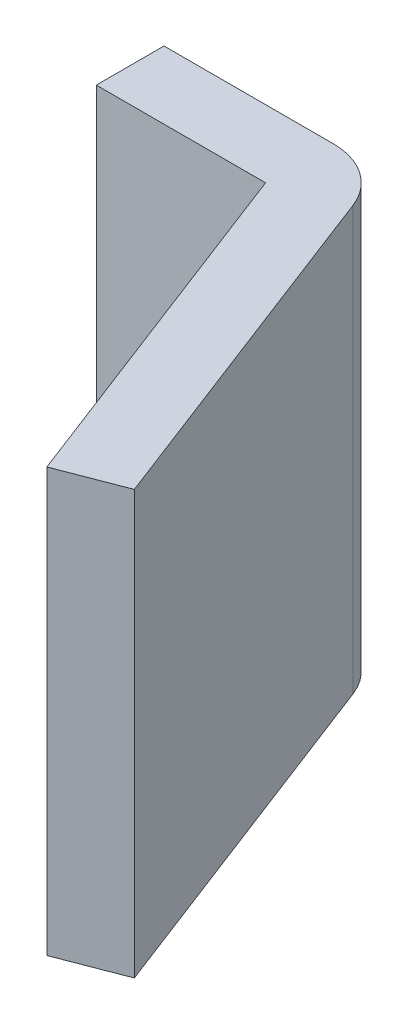
ISO-10303-21;
HEADER;
FILE_DESCRIPTION(('STEP AP214'),'2;1');
FILE_NAME('part.step','',(''),(''),'','','');
FILE_SCHEMA(('AUTOMOTIVE_DESIGN { 1 0 10303 214 1 1 1 1 }'));
ENDSEC;
DATA;
#1=APPLICATION_CONTEXT('core data for automotive mechanical design processes');
#2=APPLICATION_PROTOCOL_DEFINITION('international standard','automotive_design',2000,#1);
#3=PRODUCT_CONTEXT('',#1,'mechanical');
#4=PRODUCT('Part','Part','',(#3));
#5=PRODUCT_RELATED_PRODUCT_CATEGORY('part','',(#4));
#6=PRODUCT_DEFINITION_FORMATION('','',#4);
#7=PRODUCT_DEFINITION_CONTEXT('part definition',#1,'design');
#8=PRODUCT_DEFINITION('design','',#6,#7);
#9=PRODUCT_DEFINITION_SHAPE('','',#8);
#10=(LENGTH_UNIT() NAMED_UNIT(*) SI_UNIT(.MILLI.,.METRE.));
#11=(NAMED_UNIT(*) PLANE_ANGLE_UNIT() SI_UNIT($,.RADIAN.));
#12=(NAMED_UNIT(*) SI_UNIT($,.STERADIAN.) SOLID_ANGLE_UNIT());
#13=UNCERTAINTY_MEASURE_WITH_UNIT(LENGTH_MEASURE(1.E-05),#10,'distance_accuracy_value','');
#14=(GEOMETRIC_REPRESENTATION_CONTEXT(3) GLOBAL_UNCERTAINTY_ASSIGNED_CONTEXT((#13)) GLOBAL_UNIT_ASSIGNED_CONTEXT((#10,
#11,#12)) REPRESENTATION_CONTEXT('',''));
#15=CARTESIAN_POINT('',(0.,0.,0.));
#16=DIRECTION('',(0.,0.,1.));
#17=DIRECTION('',(1.,0.,0.));
#18=AXIS2_PLACEMENT_3D('',#15,#16,#17);
#19=CARTESIAN_POINT('',(1.8,0.5,0.0800000000000071));
#20=DIRECTION('',(0.,0.,1.));
#21=DIRECTION('',(1.,0.,0.));
#22=AXIS2_PLACEMENT_3D('',#19,#20,#21);
#23=PLANE('',#22);
#24=DIRECTION('',(1.,0.,0.));
#25=VECTOR('',#24,1.);
#26=CARTESIAN_POINT('',(2.,0.5,0.0800000000000071));
#27=LINE('',#26,#25);
#28=CARTESIAN_POINT('',(2.00000000000041,0.5,0.0800000000000071));
#29=VERTEX_POINT('',#28);
#30=CARTESIAN_POINT('',(1.8,0.5,0.0800000000000071));
#31=VERTEX_POINT('',#30);
#32=EDGE_CURVE('E115',#29,#31,#27,.F.);
#33=ORIENTED_EDGE('',*,*,#32,.T.);
#34=DIRECTION('',(0.,1.,0.));
#35=VECTOR('',#34,1.);
#36=CARTESIAN_POINT('',(1.8,0.5,0.0800000000000071));
#37=LINE('',#36,#35);
#38=CARTESIAN_POINT('',(1.8,0.,0.0800000000000071));
#39=VERTEX_POINT('',#38);
#40=EDGE_CURVE('E131',#39,#31,#37,.T.);
#41=ORIENTED_EDGE('',*,*,#40,.F.);
#42=DIRECTION('',(1.,0.,0.));
#43=VECTOR('',#42,1.);
#44=CARTESIAN_POINT('',(2.,0.,0.0800000000000071));
#45=LINE('',#44,#43);
#46=CARTESIAN_POINT('',(2.00000000000041,0.,0.0800000000000071));
#47=VERTEX_POINT('',#46);
#48=EDGE_CURVE('E123',#47,#39,#45,.F.);
#49=ORIENTED_EDGE('',*,*,#48,.F.);
#50=DIRECTION('',(0.,1.,0.));
#51=VECTOR('',#50,1.);
#52=CARTESIAN_POINT('',(2.00000000000041,0.5,0.0800000000000071));
#53=LINE('',#52,#51);
#54=EDGE_CURVE('E124',#29,#47,#53,.F.);
#55=ORIENTED_EDGE('',*,*,#54,.F.);
#56=EDGE_LOOP('',(#33,#41,#49,#55));
#57=FACE_BOUND('',#56,.T.);
#58=ADVANCED_FACE('F16',(#57),#23,.T.);
#59=CARTESIAN_POINT('',(1.8,0.5,0.));
#60=DIRECTION('',(-1.,0.,0.));
#61=DIRECTION('',(0.,0.,1.));
#62=AXIS2_PLACEMENT_3D('',#59,#60,#61);
#63=PLANE('',#62);
#64=DIRECTION('',(0.,0.,-1.));
#65=VECTOR('',#64,1.);
#66=CARTESIAN_POINT('',(1.8,0.5,0.0800000000000071));
#67=LINE('',#66,#65);
#68=CARTESIAN_POINT('',(1.8,0.5,0.));
#69=VERTEX_POINT('',#68);
#70=EDGE_CURVE('E134',#31,#69,#67,.T.);
#71=ORIENTED_EDGE('',*,*,#70,.T.);
#72=DIRECTION('',(0.,1.,0.));
#73=VECTOR('',#72,1.);
#74=CARTESIAN_POINT('',(1.8,0.5,0.));
#75=LINE('',#74,#73);
#76=CARTESIAN_POINT('',(1.8,0.,0.));
#77=VERTEX_POINT('',#76);
#78=EDGE_CURVE('E128',#77,#69,#75,.T.);
#79=ORIENTED_EDGE('',*,*,#78,.F.);
#80=DIRECTION('',(0.,0.,-1.));
#81=VECTOR('',#80,1.);
#82=CARTESIAN_POINT('',(1.8,0.,0.0800000000000071));
#83=LINE('',#82,#81);
#84=EDGE_CURVE('E105',#39,#77,#83,.T.);
#85=ORIENTED_EDGE('',*,*,#84,.F.);
#86=ORIENTED_EDGE('',*,*,#40,.T.);
#87=EDGE_LOOP('',(#71,#79,#85,#86));
#88=FACE_BOUND('',#87,.T.);
#89=ADVANCED_FACE('F172',(#88),#63,.T.);
#90=CARTESIAN_POINT('',(2.,0.5,0.));
#91=DIRECTION('',(0.,0.,-1.));
#92=DIRECTION('',(-1.,0.,0.));
#93=AXIS2_PLACEMENT_3D('',#90,#91,#92);
#94=PLANE('',#93);
#95=DIRECTION('',(1.,0.,0.));
#96=VECTOR('',#95,1.);
#97=CARTESIAN_POINT('',(2.,0.5,0.));
#98=LINE('',#97,#96);
#99=CARTESIAN_POINT('',(2.,0.5,0.));
#100=VERTEX_POINT('',#99);
#101=EDGE_CURVE('E136',#69,#100,#98,.T.);
#102=ORIENTED_EDGE('',*,*,#101,.T.);
#103=DIRECTION('',(0.,1.,0.));
#104=VECTOR('',#103,1.);
#105=CARTESIAN_POINT('',(2.,0.5,0.));
#106=LINE('',#105,#104);
#107=CARTESIAN_POINT('',(2.,0.,0.));
#108=VERTEX_POINT('',#107);
#109=EDGE_CURVE('E84',#108,#100,#106,.T.);
#110=ORIENTED_EDGE('',*,*,#109,.F.);
#111=DIRECTION('',(1.,0.,0.));
#112=VECTOR('',#111,1.);
#113=CARTESIAN_POINT('',(2.,0.,0.));
#114=LINE('',#113,#112);
#115=EDGE_CURVE('E80',#77,#108,#114,.T.);
#116=ORIENTED_EDGE('',*,*,#115,.F.);
#117=ORIENTED_EDGE('',*,*,#78,.T.);
#118=EDGE_LOOP('',(#102,#110,#116,#117));
#119=FACE_BOUND('',#118,.T.);
#120=ADVANCED_FACE('F174',(#119),#94,.T.);
#121=CARTESIAN_POINT('',(2.00000000000041,0.5,0.0800000000000071));
#122=DIRECTION('',(-0.933333333347552,0.,0.359010987105336));
#123=DIRECTION('',(0.359010987105336,0.,0.933333333347552));
#124=AXIS2_PLACEMENT_3D('',#121,#122,#123);
#125=PLANE('',#124);
#126=DIRECTION('',(-0.359010987105336,0.,-0.933333333347552));
#127=VECTOR('',#126,1.);
#128=CARTESIAN_POINT('',(2.16155494419535,0.5,0.500000000000007));
#129=LINE('',#128,#127);
#130=CARTESIAN_POINT('',(2.16155494419535,0.5,0.500000000000007));
#131=VERTEX_POINT('',#130);
#132=EDGE_CURVE('E112',#131,#29,#129,.T.);
#133=ORIENTED_EDGE('',*,*,#132,.T.);
#134=ORIENTED_EDGE('',*,*,#54,.T.);
#135=DIRECTION('',(-0.359010987105336,0.,-0.933333333347552));
#136=VECTOR('',#135,1.);
#137=CARTESIAN_POINT('',(2.16155494419535,0.,0.500000000000007));
#138=LINE('',#137,#136);
#139=CARTESIAN_POINT('',(2.16155494419535,0.,0.500000000000007));
#140=VERTEX_POINT('',#139);
#141=EDGE_CURVE('E120',#140,#47,#138,.T.);
#142=ORIENTED_EDGE('',*,*,#141,.F.);
#143=DIRECTION('',(0.,1.,0.));
#144=VECTOR('',#143,1.);
#145=CARTESIAN_POINT('',(2.16155494419535,0.5,0.500000000000007));
#146=LINE('',#145,#144);
#147=EDGE_CURVE('E94',#131,#140,#146,.F.);
#148=ORIENTED_EDGE('',*,*,#147,.F.);
#149=EDGE_LOOP('',(#133,#134,#142,#148));
#150=FACE_BOUND('',#149,.T.);
#151=ADVANCED_FACE('F178',(#150),#125,.T.);
#152=CARTESIAN_POINT('',(2.,0.,0.0800000000000071));
#153=DIRECTION('',(0.,-1.,0.));
#154=DIRECTION('',(0.,0.,-1.));
#155=AXIS2_PLACEMENT_3D('',#152,#153,#154);
#156=PLANE('',#155);
#157=ORIENTED_EDGE('',*,*,#84,.T.);
#158=ORIENTED_EDGE('',*,*,#115,.T.);
#159=CARTESIAN_POINT('',(2.,0.,0.0800000000000071));
#160=DIRECTION('',(0.,1.,0.));
#161=DIRECTION('',(0.,0.,1.));
#162=AXIS2_PLACEMENT_3D('',#159,#160,#161);
#163=CIRCLE('',#162,0.0800000000000071);
#164=CARTESIAN_POINT('',(2.07466666666849,0.,0.0512791210313932));
#165=VERTEX_POINT('',#164);
#166=EDGE_CURVE('E19',#165,#108,#163,.T.);
#167=ORIENTED_EDGE('',*,*,#166,.F.);
#168=DIRECTION('',(-0.359010987105348,0.,-0.933333333347547));
#169=VECTOR('',#168,1.);
#170=CARTESIAN_POINT('',(2.23622161086346,0.,0.471279121031461));
#171=LINE('',#170,#169);
#172=CARTESIAN_POINT('',(2.23622161086346,0.,0.471279121031461));
#173=VERTEX_POINT('',#172);
#174=EDGE_CURVE('E77',#173,#165,#171,.T.);
#175=ORIENTED_EDGE('',*,*,#174,.F.);
#176=DIRECTION('',(0.933333333347547,0.,-0.359010987105349));
#177=VECTOR('',#176,1.);
#178=CARTESIAN_POINT('',(2.16155494419535,0.,0.500000000000007));
#179=LINE('',#178,#177);
#180=EDGE_CURVE('E108',#140,#173,#179,.T.);
#181=ORIENTED_EDGE('',*,*,#180,.F.);
#182=ORIENTED_EDGE('',*,*,#141,.T.);
#183=ORIENTED_EDGE('',*,*,#48,.T.);
#184=EDGE_LOOP('',(#157,#158,#167,#175,#181,#182,#183));
#185=FACE_BOUND('',#184,.T.);
#186=ADVANCED_FACE('F74',(#185),#156,.T.);
#187=CARTESIAN_POINT('',(2.,0.5,0.0800000000000071));
#188=DIRECTION('',(0.,1.,0.));
#189=DIRECTION('',(0.,0.,1.));
#190=AXIS2_PLACEMENT_3D('',#187,#188,#189);
#191=CYLINDRICAL_SURFACE('',#190,0.0800000000000071);
#192=CARTESIAN_POINT('',(2.,0.5,0.0800000000000071));
#193=DIRECTION('',(0.,1.,0.));
#194=DIRECTION('',(0.,0.,1.));
#195=AXIS2_PLACEMENT_3D('',#192,#193,#194);
#196=CIRCLE('',#195,0.0800000000000071);
#197=CARTESIAN_POINT('',(2.07466666666849,0.5,0.0512791210313932));
#198=VERTEX_POINT('',#197);
#199=EDGE_CURVE('E89',#100,#198,#196,.F.);
#200=ORIENTED_EDGE('',*,*,#199,.T.);
#201=DIRECTION('',(0.,1.,0.));
#202=VECTOR('',#201,1.);
#203=CARTESIAN_POINT('',(2.07466666666851,0.5,0.0512791210314601));
#204=LINE('',#203,#202);
#205=EDGE_CURVE('E86',#165,#198,#204,.T.);
#206=ORIENTED_EDGE('',*,*,#205,.F.);
#207=ORIENTED_EDGE('',*,*,#166,.T.);
#208=ORIENTED_EDGE('',*,*,#109,.T.);
#209=EDGE_LOOP('',(#200,#206,#207,#208));
#210=FACE_BOUND('',#209,.T.);
#211=ADVANCED_FACE('F87',(#210),#191,.T.);
#212=CARTESIAN_POINT('',(2.,0.5,0.0800000000000071));
#213=DIRECTION('',(0.,-1.,0.));
#214=DIRECTION('',(0.,0.,-1.));
#215=AXIS2_PLACEMENT_3D('',#212,#213,#214);
#216=PLANE('',#215);
#217=ORIENTED_EDGE('',*,*,#101,.F.);
#218=ORIENTED_EDGE('',*,*,#70,.F.);
#219=ORIENTED_EDGE('',*,*,#32,.F.);
#220=ORIENTED_EDGE('',*,*,#132,.F.);
#221=DIRECTION('',(0.933333333347547,0.,-0.359010987105349));
#222=VECTOR('',#221,1.);
#223=CARTESIAN_POINT('',(2.16155494419535,0.5,0.500000000000007));
#224=LINE('',#223,#222);
#225=CARTESIAN_POINT('',(2.23622161086346,0.5,0.471279121031461));
#226=VERTEX_POINT('',#225);
#227=EDGE_CURVE('E34',#226,#131,#224,.F.);
#228=ORIENTED_EDGE('',*,*,#227,.F.);
#229=DIRECTION('',(-0.359010987105348,0.,-0.933333333347547));
#230=VECTOR('',#229,1.);
#231=CARTESIAN_POINT('',(2.23622161086346,0.5,0.471279121031461));
#232=LINE('',#231,#230);
#233=EDGE_CURVE('E25',#198,#226,#232,.F.);
#234=ORIENTED_EDGE('',*,*,#233,.F.);
#235=ORIENTED_EDGE('',*,*,#199,.F.);
#236=EDGE_LOOP('',(#217,#218,#219,#220,#228,#234,#235));
#237=FACE_BOUND('',#236,.T.);
#238=ADVANCED_FACE('F168',(#237),#216,.F.);
#239=CARTESIAN_POINT('',(2.16155494419535,0.5,0.500000000000007));
#240=DIRECTION('',(0.359010987105349,0.,0.933333333347547));
#241=DIRECTION('',(0.933333333347547,0.,-0.359010987105349));
#242=AXIS2_PLACEMENT_3D('',#239,#240,#241);
#243=PLANE('',#242);
#244=ORIENTED_EDGE('',*,*,#227,.T.);
#245=ORIENTED_EDGE('',*,*,#147,.T.);
#246=ORIENTED_EDGE('',*,*,#180,.T.);
#247=DIRECTION('',(0.,1.,0.));
#248=VECTOR('',#247,1.);
#249=CARTESIAN_POINT('',(2.23622161086346,0.5,0.471279121031461));
#250=LINE('',#249,#248);
#251=EDGE_CURVE('E11',#226,#173,#250,.F.);
#252=ORIENTED_EDGE('',*,*,#251,.F.);
#253=EDGE_LOOP('',(#244,#245,#246,#252));
#254=FACE_BOUND('',#253,.T.);
#255=ADVANCED_FACE('F166',(#254),#243,.T.);
#256=CARTESIAN_POINT('',(2.23622161086346,0.5,0.471279121031461));
#257=DIRECTION('',(0.933333333347547,0.,-0.359010987105348));
#258=DIRECTION('',(-0.359010987105348,0.,-0.933333333347547));
#259=AXIS2_PLACEMENT_3D('',#256,#257,#258);
#260=PLANE('',#259);
#261=ORIENTED_EDGE('',*,*,#233,.T.);
#262=ORIENTED_EDGE('',*,*,#251,.T.);
#263=ORIENTED_EDGE('',*,*,#174,.T.);
#264=ORIENTED_EDGE('',*,*,#205,.T.);
#265=EDGE_LOOP('',(#261,#262,#263,#264));
#266=FACE_BOUND('',#265,.T.);
#267=ADVANCED_FACE('F93',(#266),#260,.T.);
#268=CLOSED_SHELL('',(#58,#89,#120,#151,#186,#211,#238,#255,#267));
#269=MANIFOLD_SOLID_BREP('B1',#268);
#270=ADVANCED_BREP_SHAPE_REPRESENTATION('',(#18,#269),#14);
#271=SHAPE_DEFINITION_REPRESENTATION(#9,#270);
ENDSEC;
END-ISO-10303-21;
